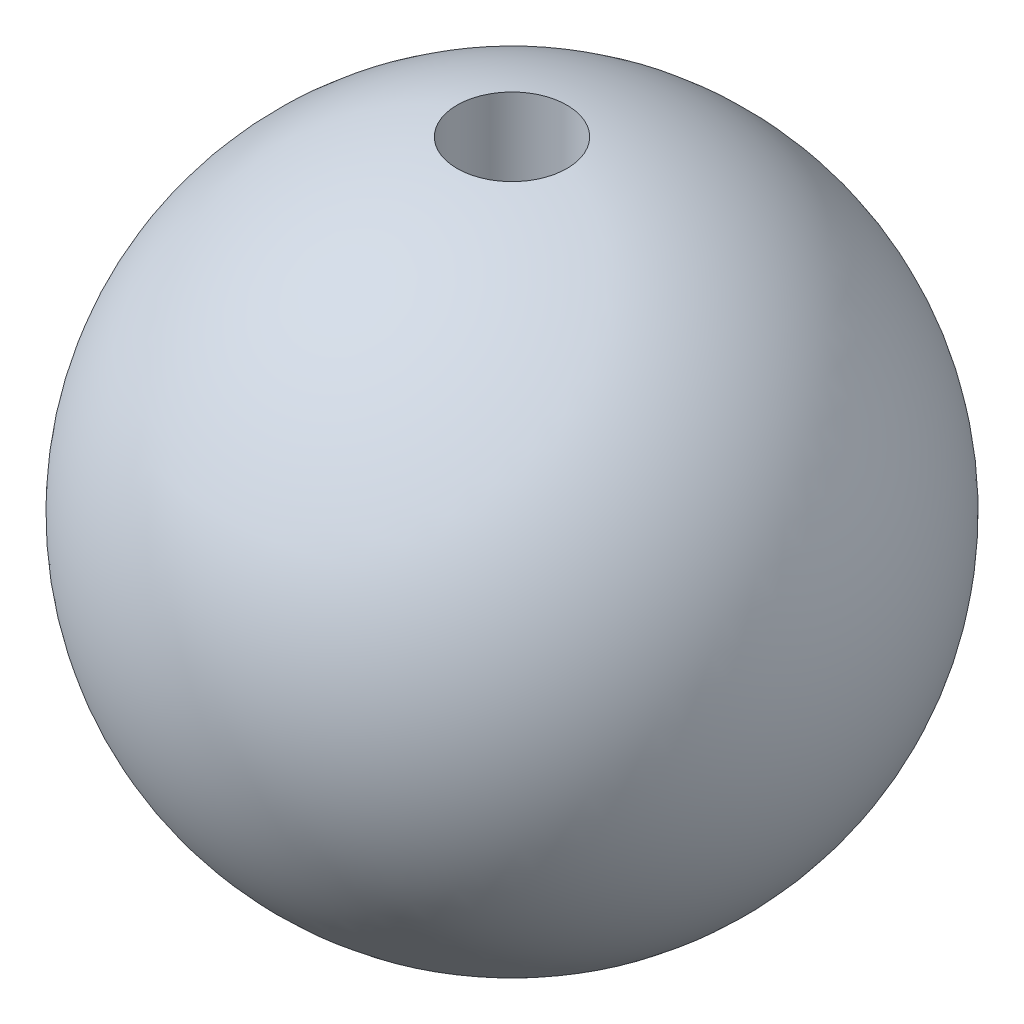
ISO-10303-21;
HEADER;
FILE_DESCRIPTION(('STEP AP214'),'2;1');
FILE_NAME('part.step','',(''),(''),'','','');
FILE_SCHEMA(('AUTOMOTIVE_DESIGN { 1 0 10303 214 1 1 1 1 }'));
ENDSEC;
DATA;
#1=APPLICATION_CONTEXT('core data for automotive mechanical design processes');
#2=APPLICATION_PROTOCOL_DEFINITION('international standard','automotive_design',2000,#1);
#3=PRODUCT_CONTEXT('',#1,'mechanical');
#4=PRODUCT('Part','Part','',(#3));
#5=PRODUCT_RELATED_PRODUCT_CATEGORY('part','',(#4));
#6=PRODUCT_DEFINITION_FORMATION('','',#4);
#7=PRODUCT_DEFINITION_CONTEXT('part definition',#1,'design');
#8=PRODUCT_DEFINITION('design','',#6,#7);
#9=PRODUCT_DEFINITION_SHAPE('','',#8);
#10=(LENGTH_UNIT() NAMED_UNIT(*) SI_UNIT(.MILLI.,.METRE.));
#11=(NAMED_UNIT(*) PLANE_ANGLE_UNIT() SI_UNIT($,.RADIAN.));
#12=(NAMED_UNIT(*) SI_UNIT($,.STERADIAN.) SOLID_ANGLE_UNIT());
#13=UNCERTAINTY_MEASURE_WITH_UNIT(LENGTH_MEASURE(1.E-05),#10,'distance_accuracy_value','');
#14=(GEOMETRIC_REPRESENTATION_CONTEXT(3) GLOBAL_UNCERTAINTY_ASSIGNED_CONTEXT((#13)) GLOBAL_UNIT_ASSIGNED_CONTEXT((#10,
#11,#12)) REPRESENTATION_CONTEXT('',''));
#15=CARTESIAN_POINT('',(0.,0.,0.));
#16=DIRECTION('',(0.,0.,1.));
#17=DIRECTION('',(1.,0.,0.));
#18=AXIS2_PLACEMENT_3D('',#15,#16,#17);
#19=CARTESIAN_POINT('',(0.,30.,0.));
#20=DIRECTION('',(0.,1.,0.));
#21=DIRECTION('',(0.,0.,1.));
#22=AXIS2_PLACEMENT_3D('',#19,#20,#21);
#23=CYLINDRICAL_SURFACE('',#22,4.99999999999999);
#24=CARTESIAN_POINT('',(0.,0.,0.));
#25=DIRECTION('',(0.,1.,0.));
#26=DIRECTION('',(0.,0.,1.));
#27=AXIS2_PLACEMENT_3D('',#24,#25,#26);
#28=CIRCLE('',#27,4.99999999999999);
#29=CARTESIAN_POINT('',(0.,0.,4.99999999999999));
#30=VERTEX_POINT('',#29);
#31=EDGE_CURVE('E43',#30,#30,#28,.T.);
#32=ORIENTED_EDGE('',*,*,#31,.F.);
#33=EDGE_LOOP('',(#32));
#34=FACE_BOUND('',#33,.T.);
#35=CARTESIAN_POINT('',(0.,29.5803989154981,0.));
#36=DIRECTION('',(0.,1.,0.));
#37=DIRECTION('',(0.,0.,1.));
#38=AXIS2_PLACEMENT_3D('',#35,#36,#37);
#39=CIRCLE('',#38,4.99999999999999);
#40=CARTESIAN_POINT('',(0.,29.5803989154981,4.99999999999999));
#41=VERTEX_POINT('',#40);
#42=EDGE_CURVE('E10',#41,#41,#39,.T.);
#43=ORIENTED_EDGE('',*,*,#42,.T.);
#44=EDGE_LOOP('',(#43));
#45=FACE_BOUND('',#44,.T.);
#46=ADVANCED_FACE('F37',(#34,#45),#23,.F.);
#47=CARTESIAN_POINT('',(0.,0.,0.));
#48=DIRECTION('',(0.,1.,0.));
#49=DIRECTION('',(-1.,0.,0.));
#50=AXIS2_PLACEMENT_3D('',#47,#48,#49);
#51=SPHERICAL_SURFACE('',#50,30.);
#52=ORIENTED_EDGE('',*,*,#42,.F.);
#53=EDGE_LOOP('',(#52));
#54=FACE_BOUND('',#53,.T.);
#55=ADVANCED_FACE('F52',(#54),#51,.T.);
#56=CARTESIAN_POINT('',(0.,0.,0.));
#57=DIRECTION('',(0.,-1.,0.));
#58=DIRECTION('',(0.,0.,-1.));
#59=AXIS2_PLACEMENT_3D('',#56,#57,#58);
#60=PLANE('',#59);
#61=ORIENTED_EDGE('',*,*,#31,.T.);
#62=EDGE_LOOP('',(#61));
#63=FACE_BOUND('',#62,.T.);
#64=ADVANCED_FACE('F49',(#63),#60,.F.);
#65=CLOSED_SHELL('',(#46,#55,#64));
#66=MANIFOLD_SOLID_BREP('B2',#65);
#67=ADVANCED_BREP_SHAPE_REPRESENTATION('',(#18,#66),#14);
#68=SHAPE_DEFINITION_REPRESENTATION(#9,#67);
ENDSEC;
END-ISO-10303-21;
